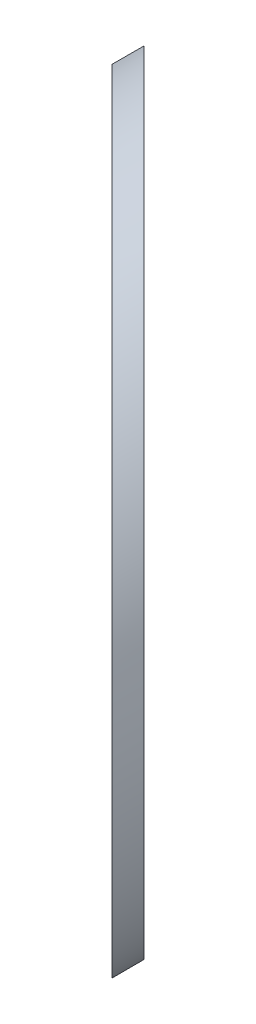
ISO-10303-21;
HEADER;
FILE_DESCRIPTION(('STEP AP214'),'2;1');
FILE_NAME('part.step','',(''),(''),'','','');
FILE_SCHEMA(('AUTOMOTIVE_DESIGN { 1 0 10303 214 1 1 1 1 }'));
ENDSEC;
DATA;
#1=APPLICATION_CONTEXT('core data for automotive mechanical design processes');
#2=APPLICATION_PROTOCOL_DEFINITION('international standard','automotive_design',2000,#1);
#3=PRODUCT_CONTEXT('',#1,'mechanical');
#4=PRODUCT('Part','Part','',(#3));
#5=PRODUCT_RELATED_PRODUCT_CATEGORY('part','',(#4));
#6=PRODUCT_DEFINITION_FORMATION('','',#4);
#7=PRODUCT_DEFINITION_CONTEXT('part definition',#1,'design');
#8=PRODUCT_DEFINITION('design','',#6,#7);
#9=PRODUCT_DEFINITION_SHAPE('','',#8);
#10=(LENGTH_UNIT() NAMED_UNIT(*) SI_UNIT(.MILLI.,.METRE.));
#11=(NAMED_UNIT(*) PLANE_ANGLE_UNIT() SI_UNIT($,.RADIAN.));
#12=(NAMED_UNIT(*) SI_UNIT($,.STERADIAN.) SOLID_ANGLE_UNIT());
#13=UNCERTAINTY_MEASURE_WITH_UNIT(LENGTH_MEASURE(1.E-05),#10,'distance_accuracy_value','');
#14=(GEOMETRIC_REPRESENTATION_CONTEXT(3) GLOBAL_UNCERTAINTY_ASSIGNED_CONTEXT((#13)) GLOBAL_UNIT_ASSIGNED_CONTEXT((#10,
#11,#12)) REPRESENTATION_CONTEXT('',''));
#15=CARTESIAN_POINT('',(0.,0.,0.));
#16=DIRECTION('',(0.,0.,1.));
#17=DIRECTION('',(1.,0.,0.));
#18=AXIS2_PLACEMENT_3D('',#15,#16,#17);
#19=CARTESIAN_POINT('',(0.,0.,61.));
#20=DIRECTION('',(0.,0.,-1.));
#21=DIRECTION('',(-1.,0.,0.));
#22=AXIS2_PLACEMENT_3D('',#19,#20,#21);
#23=CYLINDRICAL_SURFACE('',#22,12.5);
#24=CARTESIAN_POINT('',(0.,0.,19.4480630350569));
#25=DIRECTION('',(0.707106781186546,0.,-0.707106781186549));
#26=DIRECTION('',(-0.707106781186549,0.,-0.707106781186546));
#27=AXIS2_PLACEMENT_3D('',#24,#25,#26);
#28=ELLIPSE('',#27,17.6776695296637,12.5);
#29=CARTESIAN_POINT('',(-12.5,0.,6.94806303505691));
#30=VERTEX_POINT('',#29);
#31=EDGE_CURVE('E10',#30,#30,#28,.T.);
#32=ORIENTED_EDGE('',*,*,#31,.T.);
#33=EDGE_LOOP('',(#32));
#34=FACE_BOUND('',#33,.T.);
#35=CARTESIAN_POINT('',(0.,0.,18.0338494726838));
#36=DIRECTION('',(-0.707106781186546,0.,0.707106781186549));
#37=DIRECTION('',(-0.707106781186549,0.,-0.707106781186546));
#38=AXIS2_PLACEMENT_3D('',#35,#36,#37);
#39=ELLIPSE('',#38,17.6776695296637,12.5);
#40=CARTESIAN_POINT('',(-12.5,0.,5.53384947268382));
#41=VERTEX_POINT('',#40);
#42=EDGE_CURVE('E41',#41,#41,#39,.T.);
#43=ORIENTED_EDGE('',*,*,#42,.T.);
#44=EDGE_LOOP('',(#43));
#45=FACE_BOUND('',#44,.T.);
#46=ADVANCED_FACE('F35',(#34,#45),#23,.T.);
#47=CARTESIAN_POINT('',(-39.378340461429,-30.5,-21.3444909887451));
#48=DIRECTION('',(-0.707106781186546,0.,0.707106781186549));
#49=DIRECTION('',(0.707106781186549,0.,0.707106781186546));
#50=AXIS2_PLACEMENT_3D('',#47,#48,#49);
#51=PLANE('',#50);
#52=ORIENTED_EDGE('',*,*,#42,.F.);
#53=EDGE_LOOP('',(#52));
#54=FACE_BOUND('',#53,.T.);
#55=ADVANCED_FACE('F48',(#54),#51,.F.);
#56=CARTESIAN_POINT('',(-40.0854472426156,-30.5,-20.6373842075585));
#57=DIRECTION('',(0.707106781186546,0.,-0.707106781186549));
#58=DIRECTION('',(-0.707106781186549,0.,-0.707106781186546));
#59=AXIS2_PLACEMENT_3D('',#56,#57,#58);
#60=PLANE('',#59);
#61=ORIENTED_EDGE('',*,*,#31,.F.);
#62=EDGE_LOOP('',(#61));
#63=FACE_BOUND('',#62,.T.);
#64=ADVANCED_FACE('F50',(#63),#60,.F.);
#65=CLOSED_SHELL('',(#46,#55,#64));
#66=MANIFOLD_SOLID_BREP('B2',#65);
#67=ADVANCED_BREP_SHAPE_REPRESENTATION('',(#18,#66),#14);
#68=SHAPE_DEFINITION_REPRESENTATION(#9,#67);
ENDSEC;
END-ISO-10303-21;
